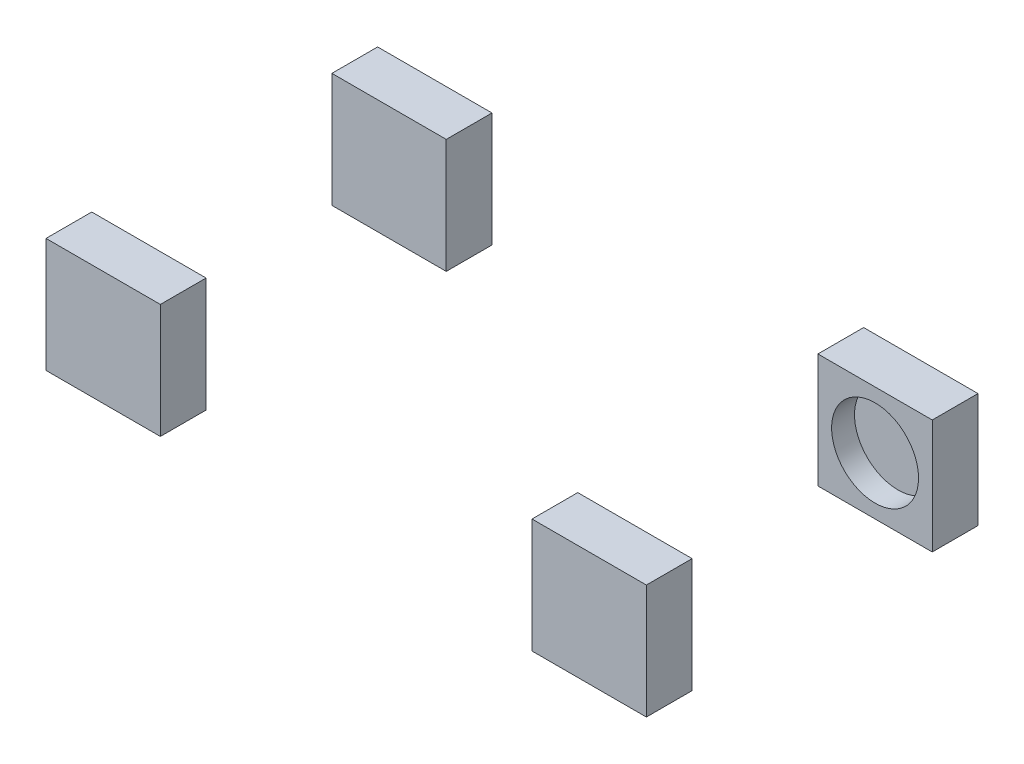
ISO-10303-21;
HEADER;
FILE_DESCRIPTION(('STEP AP214'),'2;1');
FILE_NAME('part.step','',(''),(''),'','','');
FILE_SCHEMA(('AUTOMOTIVE_DESIGN { 1 0 10303 214 1 1 1 1 }'));
ENDSEC;
DATA;
#1=APPLICATION_CONTEXT('core data for automotive mechanical design processes');
#2=APPLICATION_PROTOCOL_DEFINITION('international standard','automotive_design',2000,#1);
#3=PRODUCT_CONTEXT('',#1,'mechanical');
#4=PRODUCT('Part','Part','',(#3));
#5=PRODUCT_RELATED_PRODUCT_CATEGORY('part','',(#4));
#6=PRODUCT_DEFINITION_FORMATION('','',#4);
#7=PRODUCT_DEFINITION_CONTEXT('part definition',#1,'design');
#8=PRODUCT_DEFINITION('design','',#6,#7);
#9=PRODUCT_DEFINITION_SHAPE('','',#8);
#10=(LENGTH_UNIT() NAMED_UNIT(*) SI_UNIT(.MILLI.,.METRE.));
#11=(NAMED_UNIT(*) PLANE_ANGLE_UNIT() SI_UNIT($,.RADIAN.));
#12=(NAMED_UNIT(*) SI_UNIT($,.STERADIAN.) SOLID_ANGLE_UNIT());
#13=UNCERTAINTY_MEASURE_WITH_UNIT(LENGTH_MEASURE(1.E-05),#10,'distance_accuracy_value','');
#14=(GEOMETRIC_REPRESENTATION_CONTEXT(3) GLOBAL_UNCERTAINTY_ASSIGNED_CONTEXT((#13)) GLOBAL_UNIT_ASSIGNED_CONTEXT((#10,
#11,#12)) REPRESENTATION_CONTEXT('',''));
#15=CARTESIAN_POINT('',(0.,0.,0.));
#16=DIRECTION('',(0.,0.,1.));
#17=DIRECTION('',(1.,0.,0.));
#18=AXIS2_PLACEMENT_3D('',#15,#16,#17);
#19=CARTESIAN_POINT('',(0.,50.,105.));
#20=DIRECTION('',(0.,0.,-1.));
#21=DIRECTION('',(-1.,0.,0.));
#22=AXIS2_PLACEMENT_3D('',#19,#20,#21);
#23=PLANE('',#22);
#24=CARTESIAN_POINT('',(212.5,0.,105.));
#25=DIRECTION('',(0.,0.,-1.));
#26=DIRECTION('',(-1.,0.,0.));
#27=AXIS2_PLACEMENT_3D('',#24,#25,#26);
#28=CIRCLE('',#27,38.);
#29=CARTESIAN_POINT('',(174.5,0.,105.));
#30=VERTEX_POINT('',#29);
#31=EDGE_CURVE('E160',#30,#30,#28,.T.);
#32=ORIENTED_EDGE('',*,*,#31,.F.);
#33=EDGE_LOOP('',(#32));
#34=FACE_BOUND('',#33,.T.);
#35=DIRECTION('',(0.,-1.,0.));
#36=VECTOR('',#35,1.);
#37=CARTESIAN_POINT('',(262.5,50.,105.));
#38=LINE('',#37,#36);
#39=CARTESIAN_POINT('',(262.5,50.,105.));
#40=VERTEX_POINT('',#39);
#41=CARTESIAN_POINT('',(262.5,-50.,105.));
#42=VERTEX_POINT('',#41);
#43=EDGE_CURVE('E133',#40,#42,#38,.T.);
#44=ORIENTED_EDGE('',*,*,#43,.T.);
#45=DIRECTION('',(1.,0.,0.));
#46=VECTOR('',#45,1.);
#47=CARTESIAN_POINT('',(162.5,-50.,105.));
#48=LINE('',#47,#46);
#49=CARTESIAN_POINT('',(162.5,-50.,105.));
#50=VERTEX_POINT('',#49);
#51=EDGE_CURVE('E99',#50,#42,#48,.T.);
#52=ORIENTED_EDGE('',*,*,#51,.F.);
#53=DIRECTION('',(0.,-1.,0.));
#54=VECTOR('',#53,1.);
#55=CARTESIAN_POINT('',(162.5,50.,105.));
#56=LINE('',#55,#54);
#57=CARTESIAN_POINT('',(162.5,50.,105.));
#58=VERTEX_POINT('',#57);
#59=EDGE_CURVE('E107',#58,#50,#56,.T.);
#60=ORIENTED_EDGE('',*,*,#59,.F.);
#61=DIRECTION('',(1.,0.,0.));
#62=VECTOR('',#61,1.);
#63=CARTESIAN_POINT('',(162.5,50.,105.));
#64=LINE('',#63,#62);
#65=EDGE_CURVE('E130',#58,#40,#64,.T.);
#66=ORIENTED_EDGE('',*,*,#65,.T.);
#67=EDGE_LOOP('',(#44,#52,#60,#66));
#68=FACE_BOUND('',#67,.T.);
#69=ADVANCED_FACE('F89',(#34,#68),#23,.T.);
#70=CARTESIAN_POINT('',(0.,-50.,0.));
#71=DIRECTION('',(0.,1.,0.));
#72=DIRECTION('',(0.,0.,1.));
#73=AXIS2_PLACEMENT_3D('',#70,#71,#72);
#74=PLANE('',#73);
#75=DIRECTION('',(0.,0.,1.));
#76=VECTOR('',#75,1.);
#77=CARTESIAN_POINT('',(262.5,-50.,0.));
#78=LINE('',#77,#76);
#79=CARTESIAN_POINT('',(262.5,-50.,145.));
#80=VERTEX_POINT('',#79);
#81=EDGE_CURVE('E141',#42,#80,#78,.T.);
#82=ORIENTED_EDGE('',*,*,#81,.T.);
#83=DIRECTION('',(1.,0.,0.));
#84=VECTOR('',#83,1.);
#85=CARTESIAN_POINT('',(0.,-50.,145.));
#86=LINE('',#85,#84);
#87=CARTESIAN_POINT('',(162.5,-50.,145.));
#88=VERTEX_POINT('',#87);
#89=EDGE_CURVE('E148',#88,#80,#86,.T.);
#90=ORIENTED_EDGE('',*,*,#89,.F.);
#91=DIRECTION('',(0.,0.,1.));
#92=VECTOR('',#91,1.);
#93=CARTESIAN_POINT('',(162.5,-50.,105.));
#94=LINE('',#93,#92);
#95=EDGE_CURVE('E13',#50,#88,#94,.T.);
#96=ORIENTED_EDGE('',*,*,#95,.F.);
#97=ORIENTED_EDGE('',*,*,#51,.T.);
#98=EDGE_LOOP('',(#82,#90,#96,#97));
#99=FACE_BOUND('',#98,.T.);
#100=ADVANCED_FACE('F175',(#99),#74,.F.);
#101=CARTESIAN_POINT('',(162.5,50.,-1.12757025938492E-13));
#102=DIRECTION('',(1.,0.,0.));
#103=DIRECTION('',(0.,0.,-1.));
#104=AXIS2_PLACEMENT_3D('',#101,#102,#103);
#105=PLANE('',#104);
#106=ORIENTED_EDGE('',*,*,#95,.T.);
#107=DIRECTION('',(0.,-1.,0.));
#108=VECTOR('',#107,1.);
#109=CARTESIAN_POINT('',(162.5,50.,145.));
#110=LINE('',#109,#108);
#111=CARTESIAN_POINT('',(162.5,50.,145.));
#112=VERTEX_POINT('',#111);
#113=EDGE_CURVE('E142',#112,#88,#110,.T.);
#114=ORIENTED_EDGE('',*,*,#113,.F.);
#115=DIRECTION('',(0.,0.,1.));
#116=VECTOR('',#115,1.);
#117=CARTESIAN_POINT('',(162.5,50.,105.));
#118=LINE('',#117,#116);
#119=EDGE_CURVE('E125',#58,#112,#118,.T.);
#120=ORIENTED_EDGE('',*,*,#119,.F.);
#121=ORIENTED_EDGE('',*,*,#59,.T.);
#122=EDGE_LOOP('',(#106,#114,#120,#121));
#123=FACE_BOUND('',#122,.T.);
#124=ADVANCED_FACE('F177',(#123),#105,.F.);
#125=CARTESIAN_POINT('',(0.,50.,145.));
#126=DIRECTION('',(0.,0.,-1.));
#127=DIRECTION('',(-1.,0.,0.));
#128=AXIS2_PLACEMENT_3D('',#125,#126,#127);
#129=PLANE('',#128);
#130=ORIENTED_EDGE('',*,*,#89,.T.);
#131=DIRECTION('',(0.,-1.,0.));
#132=VECTOR('',#131,1.);
#133=CARTESIAN_POINT('',(262.5,50.,145.));
#134=LINE('',#133,#132);
#135=CARTESIAN_POINT('',(262.5,50.,145.));
#136=VERTEX_POINT('',#135);
#137=EDGE_CURVE('E151',#136,#80,#134,.T.);
#138=ORIENTED_EDGE('',*,*,#137,.F.);
#139=DIRECTION('',(1.,0.,0.));
#140=VECTOR('',#139,1.);
#141=CARTESIAN_POINT('',(0.,50.,145.));
#142=LINE('',#141,#140);
#143=EDGE_CURVE('E146',#112,#136,#142,.T.);
#144=ORIENTED_EDGE('',*,*,#143,.F.);
#145=ORIENTED_EDGE('',*,*,#113,.T.);
#146=EDGE_LOOP('',(#130,#138,#144,#145));
#147=FACE_BOUND('',#146,.T.);
#148=ADVANCED_FACE('F186',(#147),#129,.F.);
#149=CARTESIAN_POINT('',(262.5,50.,0.));
#150=DIRECTION('',(1.,0.,0.));
#151=DIRECTION('',(0.,0.,-1.));
#152=AXIS2_PLACEMENT_3D('',#149,#150,#151);
#153=PLANE('',#152);
#154=ORIENTED_EDGE('',*,*,#81,.F.);
#155=ORIENTED_EDGE('',*,*,#43,.F.);
#156=DIRECTION('',(0.,0.,1.));
#157=VECTOR('',#156,1.);
#158=CARTESIAN_POINT('',(262.5,50.,0.));
#159=LINE('',#158,#157);
#160=EDGE_CURVE('E93',#40,#136,#159,.T.);
#161=ORIENTED_EDGE('',*,*,#160,.T.);
#162=ORIENTED_EDGE('',*,*,#137,.T.);
#163=EDGE_LOOP('',(#154,#155,#161,#162));
#164=FACE_BOUND('',#163,.T.);
#165=ADVANCED_FACE('F139',(#164),#153,.T.);
#166=CARTESIAN_POINT('',(0.,50.,0.));
#167=DIRECTION('',(0.,1.,0.));
#168=DIRECTION('',(0.,0.,1.));
#169=AXIS2_PLACEMENT_3D('',#166,#167,#168);
#170=PLANE('',#169);
#171=ORIENTED_EDGE('',*,*,#160,.F.);
#172=ORIENTED_EDGE('',*,*,#65,.F.);
#173=ORIENTED_EDGE('',*,*,#119,.T.);
#174=ORIENTED_EDGE('',*,*,#143,.T.);
#175=EDGE_LOOP('',(#171,#172,#173,#174));
#176=FACE_BOUND('',#175,.T.);
#177=ADVANCED_FACE('F91',(#176),#170,.T.);
#178=CARTESIAN_POINT('',(212.5,0.,125.));
#179=DIRECTION('',(0.,0.,-1.));
#180=DIRECTION('',(-1.,0.,0.));
#181=AXIS2_PLACEMENT_3D('',#178,#179,#180);
#182=CYLINDRICAL_SURFACE('',#181,38.);
#183=CARTESIAN_POINT('',(212.5,0.,125.));
#184=DIRECTION('',(0.,0.,-1.));
#185=DIRECTION('',(-1.,0.,0.));
#186=AXIS2_PLACEMENT_3D('',#183,#184,#185);
#187=CIRCLE('',#186,38.);
#188=CARTESIAN_POINT('',(174.5,0.,125.));
#189=VERTEX_POINT('',#188);
#190=EDGE_CURVE('E143',#189,#189,#187,.T.);
#191=ORIENTED_EDGE('',*,*,#190,.F.);
#192=EDGE_LOOP('',(#191));
#193=FACE_BOUND('',#192,.T.);
#194=ORIENTED_EDGE('',*,*,#31,.T.);
#195=EDGE_LOOP('',(#194));
#196=FACE_BOUND('',#195,.T.);
#197=ADVANCED_FACE('F168',(#193,#196),#182,.F.);
#198=CARTESIAN_POINT('',(212.5,0.,125.));
#199=DIRECTION('',(0.,0.,-1.));
#200=DIRECTION('',(-1.,0.,0.));
#201=AXIS2_PLACEMENT_3D('',#198,#199,#200);
#202=PLANE('',#201);
#203=ORIENTED_EDGE('',*,*,#190,.T.);
#204=EDGE_LOOP('',(#203));
#205=FACE_BOUND('',#204,.T.);
#206=ADVANCED_FACE('F166',(#205),#202,.T.);
#207=CLOSED_SHELL('',(#69,#100,#124,#148,#165,#177,#197,#206));
#208=MANIFOLD_SOLID_BREP('B2',#207);
#209=CARTESIAN_POINT('',(-162.5,50.,-1.12757025938492E-13));
#210=DIRECTION('',(1.,0.,0.));
#211=DIRECTION('',(0.,0.,-1.));
#212=AXIS2_PLACEMENT_3D('',#209,#210,#211);
#213=PLANE('',#212);
#214=DIRECTION('',(0.,0.,1.));
#215=VECTOR('',#214,1.);
#216=CARTESIAN_POINT('',(-162.5,-50.,-1.12757025938492E-13));
#217=LINE('',#216,#215);
#218=CARTESIAN_POINT('',(-162.5,-50.,105.));
#219=VERTEX_POINT('',#218);
#220=CARTESIAN_POINT('',(-162.5,-50.,145.));
#221=VERTEX_POINT('',#220);
#222=EDGE_CURVE('E87',#219,#221,#217,.T.);
#223=ORIENTED_EDGE('',*,*,#222,.F.);
#224=DIRECTION('',(0.,-1.,0.));
#225=VECTOR('',#224,1.);
#226=CARTESIAN_POINT('',(-162.5,50.,105.));
#227=LINE('',#226,#225);
#228=CARTESIAN_POINT('',(-162.5,50.,105.));
#229=VERTEX_POINT('',#228);
#230=EDGE_CURVE('E283',#229,#219,#227,.T.);
#231=ORIENTED_EDGE('',*,*,#230,.F.);
#232=DIRECTION('',(0.,0.,1.));
#233=VECTOR('',#232,1.);
#234=CARTESIAN_POINT('',(-162.5,50.,-1.12757025938492E-13));
#235=LINE('',#234,#233);
#236=CARTESIAN_POINT('',(-162.5,50.,145.));
#237=VERTEX_POINT('',#236);
#238=EDGE_CURVE('E268',#229,#237,#235,.T.);
#239=ORIENTED_EDGE('',*,*,#238,.T.);
#240=DIRECTION('',(0.,-1.,0.));
#241=VECTOR('',#240,1.);
#242=CARTESIAN_POINT('',(-162.5,50.,145.));
#243=LINE('',#242,#241);
#244=EDGE_CURVE('E306',#237,#221,#243,.T.);
#245=ORIENTED_EDGE('',*,*,#244,.T.);
#246=EDGE_LOOP('',(#223,#231,#239,#245));
#247=FACE_BOUND('',#246,.T.);
#248=ADVANCED_FACE('F264',(#247),#213,.T.);
#249=CARTESIAN_POINT('',(0.,50.,105.));
#250=DIRECTION('',(0.,0.,1.));
#251=DIRECTION('',(1.,0.,0.));
#252=AXIS2_PLACEMENT_3D('',#249,#250,#251);
#253=PLANE('',#252);
#254=DIRECTION('',(-1.,0.,0.));
#255=VECTOR('',#254,1.);
#256=CARTESIAN_POINT('',(0.,-50.,105.));
#257=LINE('',#256,#255);
#258=CARTESIAN_POINT('',(-262.5,-50.,105.));
#259=VERTEX_POINT('',#258);
#260=EDGE_CURVE('E274',#219,#259,#257,.T.);
#261=ORIENTED_EDGE('',*,*,#260,.T.);
#262=DIRECTION('',(0.,-1.,0.));
#263=VECTOR('',#262,1.);
#264=CARTESIAN_POINT('',(-262.5,50.,105.));
#265=LINE('',#264,#263);
#266=CARTESIAN_POINT('',(-262.5,50.,105.));
#267=VERTEX_POINT('',#266);
#268=EDGE_CURVE('E321',#267,#259,#265,.T.);
#269=ORIENTED_EDGE('',*,*,#268,.F.);
#270=DIRECTION('',(-1.,0.,0.));
#271=VECTOR('',#270,1.);
#272=CARTESIAN_POINT('',(0.,50.,105.));
#273=LINE('',#272,#271);
#274=EDGE_CURVE('E298',#229,#267,#273,.T.);
#275=ORIENTED_EDGE('',*,*,#274,.F.);
#276=ORIENTED_EDGE('',*,*,#230,.T.);
#277=EDGE_LOOP('',(#261,#269,#275,#276));
#278=FACE_BOUND('',#277,.T.);
#279=ADVANCED_FACE('F337',(#278),#253,.F.);
#280=CARTESIAN_POINT('',(-262.5,50.,0.));
#281=DIRECTION('',(1.,0.,0.));
#282=DIRECTION('',(0.,0.,-1.));
#283=AXIS2_PLACEMENT_3D('',#280,#281,#282);
#284=PLANE('',#283);
#285=DIRECTION('',(0.,0.,1.));
#286=VECTOR('',#285,1.);
#287=CARTESIAN_POINT('',(-262.5,-50.,0.));
#288=LINE('',#287,#286);
#289=CARTESIAN_POINT('',(-262.5,-50.,145.));
#290=VERTEX_POINT('',#289);
#291=EDGE_CURVE('E325',#259,#290,#288,.T.);
#292=ORIENTED_EDGE('',*,*,#291,.T.);
#293=DIRECTION('',(0.,-1.,0.));
#294=VECTOR('',#293,1.);
#295=CARTESIAN_POINT('',(-262.5,50.,145.));
#296=LINE('',#295,#294);
#297=CARTESIAN_POINT('',(-262.5,50.,145.));
#298=VERTEX_POINT('',#297);
#299=EDGE_CURVE('E312',#298,#290,#296,.T.);
#300=ORIENTED_EDGE('',*,*,#299,.F.);
#301=DIRECTION('',(0.,0.,1.));
#302=VECTOR('',#301,1.);
#303=CARTESIAN_POINT('',(-262.5,50.,0.));
#304=LINE('',#303,#302);
#305=EDGE_CURVE('E335',#267,#298,#304,.T.);
#306=ORIENTED_EDGE('',*,*,#305,.F.);
#307=ORIENTED_EDGE('',*,*,#268,.T.);
#308=EDGE_LOOP('',(#292,#300,#306,#307));
#309=FACE_BOUND('',#308,.T.);
#310=ADVANCED_FACE('F326',(#309),#284,.F.);
#311=CARTESIAN_POINT('',(0.,50.,145.));
#312=DIRECTION('',(0.,0.,1.));
#313=DIRECTION('',(1.,0.,0.));
#314=AXIS2_PLACEMENT_3D('',#311,#312,#313);
#315=PLANE('',#314);
#316=DIRECTION('',(-1.,0.,0.));
#317=VECTOR('',#316,1.);
#318=CARTESIAN_POINT('',(0.,-50.,145.));
#319=LINE('',#318,#317);
#320=EDGE_CURVE('E316',#221,#290,#319,.T.);
#321=ORIENTED_EDGE('',*,*,#320,.F.);
#322=ORIENTED_EDGE('',*,*,#244,.F.);
#323=DIRECTION('',(-1.,0.,0.));
#324=VECTOR('',#323,1.);
#325=CARTESIAN_POINT('',(0.,50.,145.));
#326=LINE('',#325,#324);
#327=EDGE_CURVE('E318',#237,#298,#326,.T.);
#328=ORIENTED_EDGE('',*,*,#327,.T.);
#329=ORIENTED_EDGE('',*,*,#299,.T.);
#330=EDGE_LOOP('',(#321,#322,#328,#329));
#331=FACE_BOUND('',#330,.T.);
#332=ADVANCED_FACE('F314',(#331),#315,.T.);
#333=CARTESIAN_POINT('',(0.,50.,0.));
#334=DIRECTION('',(0.,1.,0.));
#335=DIRECTION('',(0.,0.,1.));
#336=AXIS2_PLACEMENT_3D('',#333,#334,#335);
#337=PLANE('',#336);
#338=ORIENTED_EDGE('',*,*,#238,.F.);
#339=ORIENTED_EDGE('',*,*,#274,.T.);
#340=ORIENTED_EDGE('',*,*,#305,.T.);
#341=ORIENTED_EDGE('',*,*,#327,.F.);
#342=EDGE_LOOP('',(#338,#339,#340,#341));
#343=FACE_BOUND('',#342,.T.);
#344=ADVANCED_FACE('F266',(#343),#337,.T.);
#345=CARTESIAN_POINT('',(0.,-50.,0.));
#346=DIRECTION('',(0.,1.,0.));
#347=DIRECTION('',(0.,0.,1.));
#348=AXIS2_PLACEMENT_3D('',#345,#346,#347);
#349=PLANE('',#348);
#350=ORIENTED_EDGE('',*,*,#222,.T.);
#351=ORIENTED_EDGE('',*,*,#320,.T.);
#352=ORIENTED_EDGE('',*,*,#291,.F.);
#353=ORIENTED_EDGE('',*,*,#260,.F.);
#354=EDGE_LOOP('',(#350,#351,#352,#353));
#355=FACE_BOUND('',#354,.T.);
#356=ADVANCED_FACE('F329',(#355),#349,.F.);
#357=CLOSED_SHELL('',(#248,#279,#310,#332,#344,#356));
#358=MANIFOLD_SOLID_BREP('B7',#357);
#359=CARTESIAN_POINT('',(0.,50.,-105.));
#360=DIRECTION('',(0.,0.,-1.));
#361=DIRECTION('',(-1.,0.,0.));
#362=AXIS2_PLACEMENT_3D('',#359,#360,#361);
#363=PLANE('',#362);
#364=CARTESIAN_POINT('',(212.5,0.,-105.));
#365=DIRECTION('',(0.,0.,1.));
#366=DIRECTION('',(1.,0.,0.));
#367=AXIS2_PLACEMENT_3D('',#364,#365,#366);
#368=CIRCLE('',#367,38.);
#369=CARTESIAN_POINT('',(250.5,0.,-105.));
#370=VERTEX_POINT('',#369);
#371=EDGE_CURVE('E478',#370,#370,#368,.T.);
#372=ORIENTED_EDGE('',*,*,#371,.F.);
#373=EDGE_LOOP('',(#372));
#374=FACE_BOUND('',#373,.T.);
#375=DIRECTION('',(1.,0.,0.));
#376=VECTOR('',#375,1.);
#377=CARTESIAN_POINT('',(0.,-50.,-105.));
#378=LINE('',#377,#376);
#379=CARTESIAN_POINT('',(162.5,-50.,-105.));
#380=VERTEX_POINT('',#379);
#381=CARTESIAN_POINT('',(262.5,-50.,-105.));
#382=VERTEX_POINT('',#381);
#383=EDGE_CURVE('E262',#380,#382,#378,.T.);
#384=ORIENTED_EDGE('',*,*,#383,.T.);
#385=DIRECTION('',(0.,-1.,0.));
#386=VECTOR('',#385,1.);
#387=CARTESIAN_POINT('',(262.5,50.,-105.));
#388=LINE('',#387,#386);
#389=CARTESIAN_POINT('',(262.5,50.,-105.));
#390=VERTEX_POINT('',#389);
#391=EDGE_CURVE('E473',#390,#382,#388,.T.);
#392=ORIENTED_EDGE('',*,*,#391,.F.);
#393=DIRECTION('',(1.,0.,0.));
#394=VECTOR('',#393,1.);
#395=CARTESIAN_POINT('',(0.,50.,-105.));
#396=LINE('',#395,#394);
#397=CARTESIAN_POINT('',(162.5,50.,-105.));
#398=VERTEX_POINT('',#397);
#399=EDGE_CURVE('E406',#398,#390,#396,.T.);
#400=ORIENTED_EDGE('',*,*,#399,.F.);
#401=DIRECTION('',(0.,-1.,0.));
#402=VECTOR('',#401,1.);
#403=CARTESIAN_POINT('',(162.5,50.,-105.));
#404=LINE('',#403,#402);
#405=EDGE_CURVE('E446',#398,#380,#404,.T.);
#406=ORIENTED_EDGE('',*,*,#405,.T.);
#407=EDGE_LOOP('',(#384,#392,#400,#406));
#408=FACE_BOUND('',#407,.T.);
#409=ADVANCED_FACE('F402',(#374,#408),#363,.F.);
#410=CARTESIAN_POINT('',(262.5,50.,0.));
#411=DIRECTION('',(-1.,0.,0.));
#412=DIRECTION('',(0.,0.,1.));
#413=AXIS2_PLACEMENT_3D('',#410,#411,#412);
#414=PLANE('',#413);
#415=DIRECTION('',(0.,0.,-1.));
#416=VECTOR('',#415,1.);
#417=CARTESIAN_POINT('',(262.5,-50.,0.));
#418=LINE('',#417,#416);
#419=CARTESIAN_POINT('',(262.5,-50.,-145.));
#420=VERTEX_POINT('',#419);
#421=EDGE_CURVE('E412',#382,#420,#418,.T.);
#422=ORIENTED_EDGE('',*,*,#421,.T.);
#423=DIRECTION('',(0.,-1.,0.));
#424=VECTOR('',#423,1.);
#425=CARTESIAN_POINT('',(262.5,50.,-145.));
#426=LINE('',#425,#424);
#427=CARTESIAN_POINT('',(262.5,50.,-145.));
#428=VERTEX_POINT('',#427);
#429=EDGE_CURVE('E460',#428,#420,#426,.T.);
#430=ORIENTED_EDGE('',*,*,#429,.F.);
#431=DIRECTION('',(0.,0.,-1.));
#432=VECTOR('',#431,1.);
#433=CARTESIAN_POINT('',(262.5,50.,0.));
#434=LINE('',#433,#432);
#435=EDGE_CURVE('E438',#390,#428,#434,.T.);
#436=ORIENTED_EDGE('',*,*,#435,.F.);
#437=ORIENTED_EDGE('',*,*,#391,.T.);
#438=EDGE_LOOP('',(#422,#430,#436,#437));
#439=FACE_BOUND('',#438,.T.);
#440=ADVANCED_FACE('F487',(#439),#414,.F.);
#441=CARTESIAN_POINT('',(0.,50.,-145.));
#442=DIRECTION('',(0.,0.,-1.));
#443=DIRECTION('',(-1.,0.,0.));
#444=AXIS2_PLACEMENT_3D('',#441,#442,#443);
#445=PLANE('',#444);
#446=DIRECTION('',(1.,0.,0.));
#447=VECTOR('',#446,1.);
#448=CARTESIAN_POINT('',(0.,-50.,-145.));
#449=LINE('',#448,#447);
#450=CARTESIAN_POINT('',(162.5,-50.,-145.));
#451=VERTEX_POINT('',#450);
#452=EDGE_CURVE('E462',#451,#420,#449,.T.);
#453=ORIENTED_EDGE('',*,*,#452,.F.);
#454=DIRECTION('',(0.,-1.,0.));
#455=VECTOR('',#454,1.);
#456=CARTESIAN_POINT('',(162.5,50.,-145.));
#457=LINE('',#456,#455);
#458=CARTESIAN_POINT('',(162.5,50.,-145.));
#459=VERTEX_POINT('',#458);
#460=EDGE_CURVE('E451',#459,#451,#457,.T.);
#461=ORIENTED_EDGE('',*,*,#460,.F.);
#462=DIRECTION('',(1.,0.,0.));
#463=VECTOR('',#462,1.);
#464=CARTESIAN_POINT('',(0.,50.,-145.));
#465=LINE('',#464,#463);
#466=EDGE_CURVE('E471',#459,#428,#465,.T.);
#467=ORIENTED_EDGE('',*,*,#466,.T.);
#468=ORIENTED_EDGE('',*,*,#429,.T.);
#469=EDGE_LOOP('',(#453,#461,#467,#468));
#470=FACE_BOUND('',#469,.T.);
#471=ADVANCED_FACE('F463',(#470),#445,.T.);
#472=CARTESIAN_POINT('',(162.5,50.,0.));
#473=DIRECTION('',(-1.,0.,0.));
#474=DIRECTION('',(0.,0.,1.));
#475=AXIS2_PLACEMENT_3D('',#472,#473,#474);
#476=PLANE('',#475);
#477=DIRECTION('',(0.,0.,-1.));
#478=VECTOR('',#477,1.);
#479=CARTESIAN_POINT('',(162.5,-50.,0.));
#480=LINE('',#479,#478);
#481=EDGE_CURVE('E455',#380,#451,#480,.T.);
#482=ORIENTED_EDGE('',*,*,#481,.F.);
#483=ORIENTED_EDGE('',*,*,#405,.F.);
#484=DIRECTION('',(0.,0.,-1.));
#485=VECTOR('',#484,1.);
#486=CARTESIAN_POINT('',(162.5,50.,0.));
#487=LINE('',#486,#485);
#488=EDGE_CURVE('E457',#398,#459,#487,.T.);
#489=ORIENTED_EDGE('',*,*,#488,.T.);
#490=ORIENTED_EDGE('',*,*,#460,.T.);
#491=EDGE_LOOP('',(#482,#483,#489,#490));
#492=FACE_BOUND('',#491,.T.);
#493=ADVANCED_FACE('F453',(#492),#476,.T.);
#494=CARTESIAN_POINT('',(0.,50.,0.));
#495=DIRECTION('',(0.,1.,0.));
#496=DIRECTION('',(0.,0.,1.));
#497=AXIS2_PLACEMENT_3D('',#494,#495,#496);
#498=PLANE('',#497);
#499=ORIENTED_EDGE('',*,*,#399,.T.);
#500=ORIENTED_EDGE('',*,*,#435,.T.);
#501=ORIENTED_EDGE('',*,*,#466,.F.);
#502=ORIENTED_EDGE('',*,*,#488,.F.);
#503=EDGE_LOOP('',(#499,#500,#501,#502));
#504=FACE_BOUND('',#503,.T.);
#505=ADVANCED_FACE('F404',(#504),#498,.T.);
#506=CARTESIAN_POINT('',(0.,-50.,0.));
#507=DIRECTION('',(0.,1.,0.));
#508=DIRECTION('',(0.,0.,1.));
#509=AXIS2_PLACEMENT_3D('',#506,#507,#508);
#510=PLANE('',#509);
#511=ORIENTED_EDGE('',*,*,#383,.F.);
#512=ORIENTED_EDGE('',*,*,#481,.T.);
#513=ORIENTED_EDGE('',*,*,#452,.T.);
#514=ORIENTED_EDGE('',*,*,#421,.F.);
#515=EDGE_LOOP('',(#511,#512,#513,#514));
#516=FACE_BOUND('',#515,.T.);
#517=ADVANCED_FACE('F465',(#516),#510,.F.);
#518=CARTESIAN_POINT('',(212.5,0.,-125.));
#519=DIRECTION('',(0.,0.,1.));
#520=DIRECTION('',(1.,0.,0.));
#521=AXIS2_PLACEMENT_3D('',#518,#519,#520);
#522=CYLINDRICAL_SURFACE('',#521,38.);
#523=CARTESIAN_POINT('',(212.5,0.,-125.));
#524=DIRECTION('',(0.,0.,1.));
#525=DIRECTION('',(1.,0.,0.));
#526=AXIS2_PLACEMENT_3D('',#523,#524,#525);
#527=CIRCLE('',#526,38.);
#528=CARTESIAN_POINT('',(250.5,0.,-125.));
#529=VERTEX_POINT('',#528);
#530=EDGE_CURVE('E474',#529,#529,#527,.T.);
#531=ORIENTED_EDGE('',*,*,#530,.F.);
#532=EDGE_LOOP('',(#531));
#533=FACE_BOUND('',#532,.T.);
#534=ORIENTED_EDGE('',*,*,#371,.T.);
#535=EDGE_LOOP('',(#534));
#536=FACE_BOUND('',#535,.T.);
#537=ADVANCED_FACE('F484',(#533,#536),#522,.F.);
#538=CARTESIAN_POINT('',(212.5,0.,-125.));
#539=DIRECTION('',(0.,0.,1.));
#540=DIRECTION('',(1.,0.,0.));
#541=AXIS2_PLACEMENT_3D('',#538,#539,#540);
#542=PLANE('',#541);
#543=ORIENTED_EDGE('',*,*,#530,.T.);
#544=EDGE_LOOP('',(#543));
#545=FACE_BOUND('',#544,.T.);
#546=ADVANCED_FACE('F504',(#545),#542,.T.);
#547=CLOSED_SHELL('',(#409,#440,#471,#493,#505,#517,#537,#546));
#548=MANIFOLD_SOLID_BREP('B81',#547);
#549=CARTESIAN_POINT('',(0.,50.,-105.));
#550=DIRECTION('',(0.,0.,1.));
#551=DIRECTION('',(1.,0.,0.));
#552=AXIS2_PLACEMENT_3D('',#549,#550,#551);
#553=PLANE('',#552);
#554=DIRECTION('',(-1.,0.,0.));
#555=VECTOR('',#554,1.);
#556=CARTESIAN_POINT('',(0.,-50.,-105.));
#557=LINE('',#556,#555);
#558=CARTESIAN_POINT('',(-162.5,-50.,-105.));
#559=VERTEX_POINT('',#558);
#560=CARTESIAN_POINT('',(-262.5,-50.,-105.));
#561=VERTEX_POINT('',#560);
#562=EDGE_CURVE('E629',#559,#561,#557,.T.);
#563=ORIENTED_EDGE('',*,*,#562,.F.);
#564=DIRECTION('',(0.,-1.,0.));
#565=VECTOR('',#564,1.);
#566=CARTESIAN_POINT('',(-162.5,50.,-105.));
#567=LINE('',#566,#565);
#568=CARTESIAN_POINT('',(-162.5,50.,-105.));
#569=VERTEX_POINT('',#568);
#570=EDGE_CURVE('E400',#569,#559,#567,.T.);
#571=ORIENTED_EDGE('',*,*,#570,.F.);
#572=DIRECTION('',(-1.,0.,0.));
#573=VECTOR('',#572,1.);
#574=CARTESIAN_POINT('',(0.,50.,-105.));
#575=LINE('',#574,#573);
#576=CARTESIAN_POINT('',(-262.5,50.,-105.));
#577=VERTEX_POINT('',#576);
#578=EDGE_CURVE('E610',#569,#577,#575,.T.);
#579=ORIENTED_EDGE('',*,*,#578,.T.);
#580=DIRECTION('',(0.,-1.,0.));
#581=VECTOR('',#580,1.);
#582=CARTESIAN_POINT('',(-262.5,50.,-105.));
#583=LINE('',#582,#581);
#584=EDGE_CURVE('E578',#577,#561,#583,.T.);
#585=ORIENTED_EDGE('',*,*,#584,.T.);
#586=EDGE_LOOP('',(#563,#571,#579,#585));
#587=FACE_BOUND('',#586,.T.);
#588=ADVANCED_FACE('F561',(#587),#553,.T.);
#589=CARTESIAN_POINT('',(-162.5,50.,0.));
#590=DIRECTION('',(-1.,0.,0.));
#591=DIRECTION('',(0.,0.,1.));
#592=AXIS2_PLACEMENT_3D('',#589,#590,#591);
#593=PLANE('',#592);
#594=DIRECTION('',(0.,0.,-1.));
#595=VECTOR('',#594,1.);
#596=CARTESIAN_POINT('',(-162.5,-50.,0.));
#597=LINE('',#596,#595);
#598=CARTESIAN_POINT('',(-162.5,-50.,-145.));
#599=VERTEX_POINT('',#598);
#600=EDGE_CURVE('E617',#559,#599,#597,.T.);
#601=ORIENTED_EDGE('',*,*,#600,.T.);
#602=DIRECTION('',(0.,-1.,0.));
#603=VECTOR('',#602,1.);
#604=CARTESIAN_POINT('',(-162.5,50.,-145.));
#605=LINE('',#604,#603);
#606=CARTESIAN_POINT('',(-162.5,50.,-145.));
#607=VERTEX_POINT('',#606);
#608=EDGE_CURVE('E570',#607,#599,#605,.T.);
#609=ORIENTED_EDGE('',*,*,#608,.F.);
#610=DIRECTION('',(0.,0.,-1.));
#611=VECTOR('',#610,1.);
#612=CARTESIAN_POINT('',(-162.5,50.,0.));
#613=LINE('',#612,#611);
#614=EDGE_CURVE('E604',#569,#607,#613,.T.);
#615=ORIENTED_EDGE('',*,*,#614,.F.);
#616=ORIENTED_EDGE('',*,*,#570,.T.);
#617=EDGE_LOOP('',(#601,#609,#615,#616));
#618=FACE_BOUND('',#617,.T.);
#619=ADVANCED_FACE('F615',(#618),#593,.F.);
#620=CARTESIAN_POINT('',(0.,50.,-145.));
#621=DIRECTION('',(0.,0.,1.));
#622=DIRECTION('',(1.,0.,0.));
#623=AXIS2_PLACEMENT_3D('',#620,#621,#622);
#624=PLANE('',#623);
#625=DIRECTION('',(-1.,0.,0.));
#626=VECTOR('',#625,1.);
#627=CARTESIAN_POINT('',(0.,-50.,-145.));
#628=LINE('',#627,#626);
#629=CARTESIAN_POINT('',(-262.5,-50.,-145.));
#630=VERTEX_POINT('',#629);
#631=EDGE_CURVE('E634',#599,#630,#628,.T.);
#632=ORIENTED_EDGE('',*,*,#631,.T.);
#633=DIRECTION('',(0.,-1.,0.));
#634=VECTOR('',#633,1.);
#635=CARTESIAN_POINT('',(-262.5,50.,-145.));
#636=LINE('',#635,#634);
#637=CARTESIAN_POINT('',(-262.5,50.,-145.));
#638=VERTEX_POINT('',#637);
#639=EDGE_CURVE('E592',#638,#630,#636,.T.);
#640=ORIENTED_EDGE('',*,*,#639,.F.);
#641=DIRECTION('',(-1.,0.,0.));
#642=VECTOR('',#641,1.);
#643=CARTESIAN_POINT('',(0.,50.,-145.));
#644=LINE('',#643,#642);
#645=EDGE_CURVE('E609',#607,#638,#644,.T.);
#646=ORIENTED_EDGE('',*,*,#645,.F.);
#647=ORIENTED_EDGE('',*,*,#608,.T.);
#648=EDGE_LOOP('',(#632,#640,#646,#647));
#649=FACE_BOUND('',#648,.T.);
#650=ADVANCED_FACE('F621',(#649),#624,.F.);
#651=CARTESIAN_POINT('',(-262.5,50.,0.));
#652=DIRECTION('',(-1.,0.,0.));
#653=DIRECTION('',(0.,0.,1.));
#654=AXIS2_PLACEMENT_3D('',#651,#652,#653);
#655=PLANE('',#654);
#656=DIRECTION('',(0.,0.,-1.));
#657=VECTOR('',#656,1.);
#658=CARTESIAN_POINT('',(-262.5,-50.,0.));
#659=LINE('',#658,#657);
#660=EDGE_CURVE('E637',#561,#630,#659,.T.);
#661=ORIENTED_EDGE('',*,*,#660,.F.);
#662=ORIENTED_EDGE('',*,*,#584,.F.);
#663=DIRECTION('',(0.,0.,-1.));
#664=VECTOR('',#663,1.);
#665=CARTESIAN_POINT('',(-262.5,50.,0.));
#666=LINE('',#665,#664);
#667=EDGE_CURVE('E623',#577,#638,#666,.T.);
#668=ORIENTED_EDGE('',*,*,#667,.T.);
#669=ORIENTED_EDGE('',*,*,#639,.T.);
#670=EDGE_LOOP('',(#661,#662,#668,#669));
#671=FACE_BOUND('',#670,.T.);
#672=ADVANCED_FACE('F646',(#671),#655,.T.);
#673=CARTESIAN_POINT('',(0.,50.,0.));
#674=DIRECTION('',(0.,1.,0.));
#675=DIRECTION('',(0.,0.,1.));
#676=AXIS2_PLACEMENT_3D('',#673,#674,#675);
#677=PLANE('',#676);
#678=ORIENTED_EDGE('',*,*,#578,.F.);
#679=ORIENTED_EDGE('',*,*,#614,.T.);
#680=ORIENTED_EDGE('',*,*,#645,.T.);
#681=ORIENTED_EDGE('',*,*,#667,.F.);
#682=EDGE_LOOP('',(#678,#679,#680,#681));
#683=FACE_BOUND('',#682,.T.);
#684=ADVANCED_FACE('F606',(#683),#677,.T.);
#685=CARTESIAN_POINT('',(0.,-50.,0.));
#686=DIRECTION('',(0.,1.,0.));
#687=DIRECTION('',(0.,0.,1.));
#688=AXIS2_PLACEMENT_3D('',#685,#686,#687);
#689=PLANE('',#688);
#690=ORIENTED_EDGE('',*,*,#562,.T.);
#691=ORIENTED_EDGE('',*,*,#660,.T.);
#692=ORIENTED_EDGE('',*,*,#631,.F.);
#693=ORIENTED_EDGE('',*,*,#600,.F.);
#694=EDGE_LOOP('',(#690,#691,#692,#693));
#695=FACE_BOUND('',#694,.T.);
#696=ADVANCED_FACE('F653',(#695),#689,.F.);
#697=CLOSED_SHELL('',(#588,#619,#650,#672,#684,#696));
#698=MANIFOLD_SOLID_BREP('B256',#697);
#699=ADVANCED_BREP_SHAPE_REPRESENTATION('',(#18,#208,#358,#548,#698),#14);
#700=SHAPE_DEFINITION_REPRESENTATION(#9,#699);
ENDSEC;
END-ISO-10303-21;
